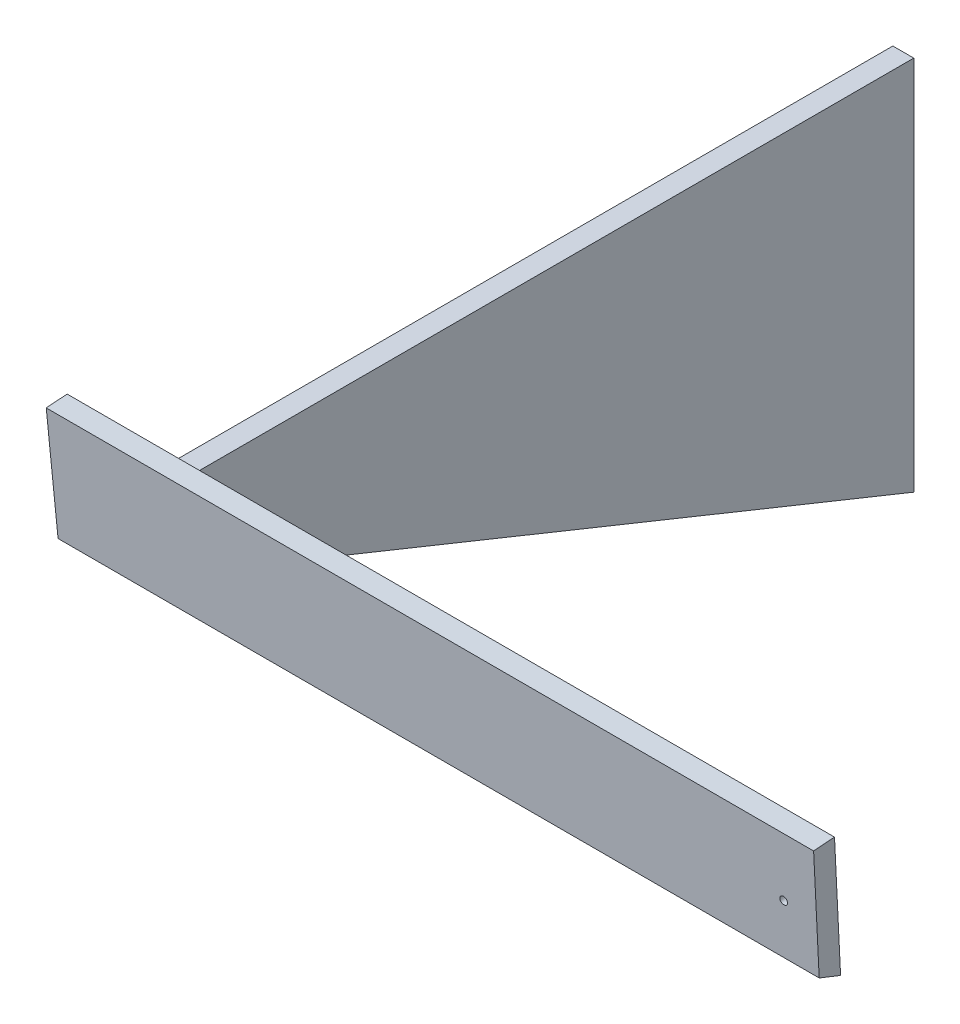
ISO-10303-21;
HEADER;
FILE_DESCRIPTION(('STEP AP214'),'2;1');
FILE_NAME('part.step','',(''),(''),'','','');
FILE_SCHEMA(('AUTOMOTIVE_DESIGN { 1 0 10303 214 1 1 1 1 }'));
ENDSEC;
DATA;
#1=APPLICATION_CONTEXT('core data for automotive mechanical design processes');
#2=APPLICATION_PROTOCOL_DEFINITION('international standard','automotive_design',2000,#1);
#3=PRODUCT_CONTEXT('',#1,'mechanical');
#4=PRODUCT('Part','Part','',(#3));
#5=PRODUCT_RELATED_PRODUCT_CATEGORY('part','',(#4));
#6=PRODUCT_DEFINITION_FORMATION('','',#4);
#7=PRODUCT_DEFINITION_CONTEXT('part definition',#1,'design');
#8=PRODUCT_DEFINITION('design','',#6,#7);
#9=PRODUCT_DEFINITION_SHAPE('','',#8);
#10=(LENGTH_UNIT() NAMED_UNIT(*) SI_UNIT(.MILLI.,.METRE.));
#11=(NAMED_UNIT(*) PLANE_ANGLE_UNIT() SI_UNIT($,.RADIAN.));
#12=(NAMED_UNIT(*) SI_UNIT($,.STERADIAN.) SOLID_ANGLE_UNIT());
#13=UNCERTAINTY_MEASURE_WITH_UNIT(LENGTH_MEASURE(1.E-05),#10,'distance_accuracy_value','');
#14=(GEOMETRIC_REPRESENTATION_CONTEXT(3) GLOBAL_UNCERTAINTY_ASSIGNED_CONTEXT((#13)) GLOBAL_UNIT_ASSIGNED_CONTEXT((#10,
#11,#12)) REPRESENTATION_CONTEXT('',''));
#15=CARTESIAN_POINT('',(0.,0.,0.));
#16=DIRECTION('',(0.,0.,1.));
#17=DIRECTION('',(1.,0.,0.));
#18=AXIS2_PLACEMENT_3D('',#15,#16,#17);
#19=CARTESIAN_POINT('',(-266.700000000033,6812.73593849404,3017.19500052049));
#20=DIRECTION('',(1.,0.,0.));
#21=DIRECTION('',(0.,1.,0.));
#22=AXIS2_PLACEMENT_3D('',#19,#20,#21);
#23=PLANE('',#22);
#24=CARTESIAN_POINT('',(-266.700000000027,6942.45499014012,3318.50999999998));
#25=DIRECTION('',(-1.,1.19356260075173E-13,0.));
#26=DIRECTION('',(-1.19356260075173E-13,-1.,0.));
#27=AXIS2_PLACEMENT_3D('',#24,#25,#26);
#28=CIRCLE('',#27,3.49249999999985);
#29=CARTESIAN_POINT('',(-266.700000000028,6938.96249014011,3318.50999999998));
#30=VERTEX_POINT('',#29);
#31=EDGE_CURVE('P0_E19',#30,#30,#28,.F.);
#32=ORIENTED_EDGE('',*,*,#31,.T.);
#33=EDGE_LOOP('',(#32));
#34=FACE_BOUND('',#33,.T.);
#35=DIRECTION('',(0.,0.37460659341596,0.927183854566768));
#36=VECTOR('',#35,1.);
#37=CARTESIAN_POINT('',(-266.700000000025,6641.741886848,2683.51));
#38=LINE('',#37,#36);
#39=CARTESIAN_POINT('',(-266.700000000029,6641.741886848,2683.51));
#40=VERTEX_POINT('',#39);
#41=CARTESIAN_POINT('',(-266.700000000031,6909.11469486815,3345.28092209158));
#42=VERTEX_POINT('',#41);
#43=EDGE_CURVE('P0_E59',#40,#42,#38,.T.);
#44=ORIENTED_EDGE('',*,*,#43,.T.);
#45=DIRECTION('',(0.,0.997196386906827,0.0748289111237776));
#46=VECTOR('',#45,1.);
#47=CARTESIAN_POINT('',(-266.700000000036,6909.11469486815,3345.28092209158));
#48=LINE('',#47,#46);
#49=CARTESIAN_POINT('',(-266.700000000037,6983.72999014007,3350.880001041));
#50=VERTEX_POINT('',#49);
#51=EDGE_CURVE('P0_E56',#42,#50,#48,.T.);
#52=ORIENTED_EDGE('',*,*,#51,.T.);
#53=DIRECTION('',(0.,0.,1.));
#54=VECTOR('',#53,1.);
#55=CARTESIAN_POINT('',(-266.700000000038,6983.72999014007,3350.880001041));
#56=LINE('',#55,#54);
#57=CARTESIAN_POINT('',(-266.700000000038,6983.72999014007,2683.51));
#58=VERTEX_POINT('',#57);
#59=EDGE_CURVE('P0_E82',#50,#58,#56,.F.);
#60=ORIENTED_EDGE('',*,*,#59,.T.);
#61=DIRECTION('',(0.,1.,0.));
#62=VECTOR('',#61,1.);
#63=CARTESIAN_POINT('',(-266.700000000038,6983.72999014007,2683.51));
#64=LINE('',#63,#62);
#65=EDGE_CURVE('P0_E60',#58,#40,#64,.F.);
#66=ORIENTED_EDGE('',*,*,#65,.T.);
#67=EDGE_LOOP('',(#44,#52,#60,#66));
#68=FACE_BOUND('',#67,.T.);
#69=ADVANCED_FACE('P0_F16',(#34,#68),#23,.F.);
#70=CARTESIAN_POINT('',(-266.700000000025,6641.741886848,2683.51));
#71=DIRECTION('',(0.,0.927183854566768,-0.37460659341596));
#72=DIRECTION('',(0.,0.37460659341596,0.927183854566768));
#73=AXIS2_PLACEMENT_3D('',#70,#71,#72);
#74=PLANE('',#73);
#75=DIRECTION('',(1.,0.,0.));
#76=VECTOR('',#75,1.);
#77=CARTESIAN_POINT('',(-266.700000000038,6641.741886848,2683.51));
#78=LINE('',#77,#76);
#79=CARTESIAN_POINT('',(-247.65000000003,6641.741886848,2683.51));
#80=VERTEX_POINT('',#79);
#81=EDGE_CURVE('P0_E85',#40,#80,#78,.T.);
#82=ORIENTED_EDGE('',*,*,#81,.T.);
#83=DIRECTION('',(0.,0.374606593415949,0.927183854566772));
#84=VECTOR('',#83,1.);
#85=CARTESIAN_POINT('',(-247.650000000019,6641.741886848,2683.51));
#86=LINE('',#85,#84);
#87=CARTESIAN_POINT('',(-247.650000000037,6909.11469486815,3345.28092209158));
#88=VERTEX_POINT('',#87);
#89=EDGE_CURVE('P0_E77',#80,#88,#86,.T.);
#90=ORIENTED_EDGE('',*,*,#89,.T.);
#91=DIRECTION('',(1.,0.,0.));
#92=VECTOR('',#91,1.);
#93=CARTESIAN_POINT('',(-266.700000000036,6909.11469486815,3345.28092209158));
#94=LINE('',#93,#92);
#95=EDGE_CURVE('P0_E65',#88,#42,#94,.F.);
#96=ORIENTED_EDGE('',*,*,#95,.T.);
#97=ORIENTED_EDGE('',*,*,#43,.F.);
#98=EDGE_LOOP('',(#82,#90,#96,#97));
#99=FACE_BOUND('',#98,.T.);
#100=ADVANCED_FACE('P0_F76',(#99),#74,.F.);
#101=CARTESIAN_POINT('',(-266.700000000036,6909.11469486815,3345.28092209158));
#102=DIRECTION('',(0.,0.0748289111237776,-0.997196386906827));
#103=DIRECTION('',(0.,0.997196386906827,0.0748289111237776));
#104=AXIS2_PLACEMENT_3D('',#101,#102,#103);
#105=PLANE('',#104);
#106=ORIENTED_EDGE('',*,*,#95,.F.);
#107=DIRECTION('',(0.,0.997196386906838,0.074828911123633));
#108=VECTOR('',#107,1.);
#109=CARTESIAN_POINT('',(-247.650000000035,6909.11469486815,3345.28092209158));
#110=LINE('',#109,#108);
#111=CARTESIAN_POINT('',(-247.650000000039,6983.72999014007,3350.880001041));
#112=VERTEX_POINT('',#111);
#113=EDGE_CURVE('P0_E91',#88,#112,#110,.T.);
#114=ORIENTED_EDGE('',*,*,#113,.T.);
#115=DIRECTION('',(1.,0.,0.));
#116=VECTOR('',#115,1.);
#117=CARTESIAN_POINT('',(-266.700000000038,6983.72999014007,3350.880001041));
#118=LINE('',#117,#116);
#119=EDGE_CURVE('P0_E72',#112,#50,#118,.F.);
#120=ORIENTED_EDGE('',*,*,#119,.T.);
#121=ORIENTED_EDGE('',*,*,#51,.F.);
#122=EDGE_LOOP('',(#106,#114,#120,#121));
#123=FACE_BOUND('',#122,.T.);
#124=ADVANCED_FACE('P0_F69',(#123),#105,.F.);
#125=CARTESIAN_POINT('',(-266.700000000038,6983.72999014007,3350.880001041));
#126=DIRECTION('',(0.,-1.,0.));
#127=DIRECTION('',(1.,0.,0.));
#128=AXIS2_PLACEMENT_3D('',#125,#126,#127);
#129=PLANE('',#128);
#130=ORIENTED_EDGE('',*,*,#119,.F.);
#131=DIRECTION('',(0.,0.,1.));
#132=VECTOR('',#131,1.);
#133=CARTESIAN_POINT('',(-247.650000000039,6983.72999014007,3017.19500052049));
#134=LINE('',#133,#132);
#135=CARTESIAN_POINT('',(-247.650000000036,6983.72999014007,2683.51));
#136=VERTEX_POINT('',#135);
#137=EDGE_CURVE('P0_E94',#112,#136,#134,.F.);
#138=ORIENTED_EDGE('',*,*,#137,.T.);
#139=DIRECTION('',(1.,0.,0.));
#140=VECTOR('',#139,1.);
#141=CARTESIAN_POINT('',(-266.700000000038,6983.72999014007,2683.51));
#142=LINE('',#141,#140);
#143=EDGE_CURVE('P0_E34',#136,#58,#142,.F.);
#144=ORIENTED_EDGE('',*,*,#143,.T.);
#145=ORIENTED_EDGE('',*,*,#59,.F.);
#146=EDGE_LOOP('',(#130,#138,#144,#145));
#147=FACE_BOUND('',#146,.T.);
#148=ADVANCED_FACE('P0_F103',(#147),#129,.F.);
#149=CARTESIAN_POINT('',(-266.700000000038,6983.72999014007,2683.51));
#150=DIRECTION('',(0.,0.,1.));
#151=DIRECTION('',(1.,0.,0.));
#152=AXIS2_PLACEMENT_3D('',#149,#150,#151);
#153=PLANE('',#152);
#154=ORIENTED_EDGE('',*,*,#143,.F.);
#155=DIRECTION('',(0.,-1.,0.));
#156=VECTOR('',#155,1.);
#157=CARTESIAN_POINT('',(-247.650000000029,6812.73593849404,2683.51));
#158=LINE('',#157,#156);
#159=EDGE_CURVE('P0_E26',#136,#80,#158,.T.);
#160=ORIENTED_EDGE('',*,*,#159,.T.);
#161=ORIENTED_EDGE('',*,*,#81,.F.);
#162=ORIENTED_EDGE('',*,*,#65,.F.);
#163=EDGE_LOOP('',(#154,#160,#161,#162));
#164=FACE_BOUND('',#163,.T.);
#165=ADVANCED_FACE('P0_F98',(#164),#153,.F.);
#166=CARTESIAN_POINT('',(285.750000000008,6942.45499014005,3318.51));
#167=DIRECTION('',(-1.,1.19356260075173E-13,0.));
#168=DIRECTION('',(-1.19356260075173E-13,-1.,0.));
#169=AXIS2_PLACEMENT_3D('',#166,#167,#168);
#170=CYLINDRICAL_SURFACE('',#169,3.49249999999985);
#171=CARTESIAN_POINT('',(-247.650000000023,6942.45499014011,3318.50999999998));
#172=DIRECTION('',(-1.,1.19356260075173E-13,0.));
#173=DIRECTION('',(-1.19356260075173E-13,-1.,0.));
#174=AXIS2_PLACEMENT_3D('',#171,#172,#173);
#175=CIRCLE('',#174,3.49249999999985);
#176=CARTESIAN_POINT('',(-247.650000000023,6938.96249014011,3318.50999999998));
#177=VERTEX_POINT('',#176);
#178=EDGE_CURVE('P0_E11',#177,#177,#175,.F.);
#179=ORIENTED_EDGE('',*,*,#178,.T.);
#180=EDGE_LOOP('',(#179));
#181=FACE_BOUND('',#180,.T.);
#182=ORIENTED_EDGE('',*,*,#31,.F.);
#183=EDGE_LOOP('',(#182));
#184=FACE_BOUND('',#183,.T.);
#185=ADVANCED_FACE('P0_F111',(#181,#184),#170,.F.);
#186=CARTESIAN_POINT('',(-247.650000000029,6812.73593849404,3017.19500052049));
#187=DIRECTION('',(-1.,0.,0.));
#188=DIRECTION('',(0.,-1.,0.));
#189=AXIS2_PLACEMENT_3D('',#186,#187,#188);
#190=PLANE('',#189);
#191=ORIENTED_EDGE('',*,*,#178,.F.);
#192=EDGE_LOOP('',(#191));
#193=FACE_BOUND('',#192,.T.);
#194=ORIENTED_EDGE('',*,*,#137,.F.);
#195=ORIENTED_EDGE('',*,*,#113,.F.);
#196=ORIENTED_EDGE('',*,*,#89,.F.);
#197=ORIENTED_EDGE('',*,*,#159,.F.);
#198=EDGE_LOOP('',(#194,#195,#196,#197));
#199=FACE_BOUND('',#198,.T.);
#200=ADVANCED_FACE('P0_F101',(#193,#199),#190,.F.);
#201=CLOSED_SHELL('',(#69,#100,#124,#148,#165,#185,#200));
#202=MANIFOLD_SOLID_BREP('P0_B1',#201);
#203=CARTESIAN_POINT('',(-1.13686837721616E-12,6895.88587766805,3363.3918));
#204=DIRECTION('',(0.,-0.0748289111295014,0.997196386906397));
#205=DIRECTION('',(0.,-0.997196386906397,-0.0748289111295014));
#206=AXIS2_PLACEMENT_3D('',#203,#204,#205);
#207=PLANE('',#206);
#208=CARTESIAN_POINT('',(317.5,6944.36472836717,3367.02961864662));
#209=DIRECTION('',(0.,0.0748289111295012,-0.997196386906397));
#210=DIRECTION('',(0.,0.997196386906397,0.0748289111295012));
#211=AXIS2_PLACEMENT_3D('',#208,#209,#210);
#212=CIRCLE('',#211,3.50520000000003);
#213=CARTESIAN_POINT('',(317.5,6947.86010114256,3367.29190894591));
#214=VERTEX_POINT('',#213);
#215=EDGE_CURVE('P1_E20',#214,#214,#212,.T.);
#216=ORIENTED_EDGE('',*,*,#215,.T.);
#217=EDGE_LOOP('',(#216));
#218=FACE_BOUND('',#217,.T.);
#219=DIRECTION('',(-0.0268750444697434,0.996836200329245,0.0748018829836659));
#220=VECTOR('',#219,1.);
#221=CARTESIAN_POINT('',(-346.19763219035,6895.88587766805,3363.3918));
#222=LINE('',#221,#220);
#223=CARTESIAN_POINT('',(-346.197632190351,6895.88587766805,3363.3918));
#224=VERTEX_POINT('',#223);
#225=CARTESIAN_POINT('',(-349.041102326057,7001.35450187887,3371.30609091767));
#226=VERTEX_POINT('',#225);
#227=EDGE_CURVE('P1_E76',#224,#226,#222,.T.);
#228=ORIENTED_EDGE('',*,*,#227,.F.);
#229=DIRECTION('',(1.,0.,0.));
#230=VECTOR('',#229,1.);
#231=CARTESIAN_POINT('',(0.,6895.88587766805,3363.3918));
#232=LINE('',#231,#230);
#233=CARTESIAN_POINT('',(346.197632190351,6895.88587766805,3363.3918));
#234=VERTEX_POINT('',#233);
#235=EDGE_CURVE('P1_E58',#234,#224,#232,.F.);
#236=ORIENTED_EDGE('',*,*,#235,.F.);
#237=DIRECTION('',(0.0268750444697434,0.996836200329245,0.0748018829836659));
#238=VECTOR('',#237,1.);
#239=CARTESIAN_POINT('',(346.19763219035,6895.88587766805,3363.3918));
#240=LINE('',#239,#238);
#241=CARTESIAN_POINT('',(349.041102326057,7001.35450187887,3371.30609091767));
#242=VERTEX_POINT('',#241);
#243=EDGE_CURVE('P1_E65',#234,#242,#240,.T.);
#244=ORIENTED_EDGE('',*,*,#243,.T.);
#245=DIRECTION('',(1.,0.,0.));
#246=VECTOR('',#245,1.);
#247=CARTESIAN_POINT('',(0.,7001.35450187887,3371.30609091767));
#248=LINE('',#247,#246);
#249=EDGE_CURVE('P1_E96',#226,#242,#248,.T.);
#250=ORIENTED_EDGE('',*,*,#249,.F.);
#251=EDGE_LOOP('',(#228,#236,#244,#250));
#252=FACE_BOUND('',#251,.T.);
#253=ADVANCED_FACE('P1_F17',(#218,#252),#207,.T.);
#254=CARTESIAN_POINT('',(315.783406950661,5767.77608949546,3278.73923989057));
#255=DIRECTION('',(-0.999638800759929,0.0267996972431762,0.00201103031422791));
#256=DIRECTION('',(-0.0267997514355836,-0.999640822157134,0.));
#257=AXIS2_PLACEMENT_3D('',#254,#255,#256);
#258=PLANE('',#257);
#259=DIRECTION('',(-0.0268750444697436,-0.996836200329245,-0.0748018829836711));
#260=VECTOR('',#259,1.);
#261=CARTESIAN_POINT('',(349.041102326056,7002.77999263588,3352.30949974709));
#262=LINE('',#261,#260);
#263=CARTESIAN_POINT('',(349.041102326057,7002.77999263588,3352.30949974709));
#264=VERTEX_POINT('',#263);
#265=CARTESIAN_POINT('',(345.944605360313,6887.9262191607,3343.69095387078));
#266=VERTEX_POINT('',#265);
#267=EDGE_CURVE('P1_E99',#264,#266,#262,.T.);
#268=ORIENTED_EDGE('',*,*,#267,.F.);
#269=DIRECTION('',(0.,-0.0748289111295065,0.997196386906397));
#270=VECTOR('',#269,1.);
#271=CARTESIAN_POINT('',(349.041102326056,7001.35450187887,3371.30609091767));
#272=LINE('',#271,#270);
#273=EDGE_CURVE('P1_E70',#242,#264,#272,.F.);
#274=ORIENTED_EDGE('',*,*,#273,.F.);
#275=ORIENTED_EDGE('',*,*,#243,.F.);
#276=DIRECTION('',(0.0119073951332687,0.374580035478333,0.927118121364366));
#277=VECTOR('',#276,1.);
#278=CARTESIAN_POINT('',(345.944605360312,6887.9262191607,3343.69095387078));
#279=LINE('',#278,#277);
#280=EDGE_CURVE('P1_E67',#266,#234,#279,.T.);
#281=ORIENTED_EDGE('',*,*,#280,.F.);
#282=EDGE_LOOP('',(#268,#274,#275,#281));
#283=FACE_BOUND('',#282,.T.);
#284=ADVANCED_FACE('P1_F66',(#283),#258,.F.);
#285=CARTESIAN_POINT('',(0.,6887.9262191607,3343.69095387078));
#286=DIRECTION('',(0.,-0.927183854566753,0.374606593415996));
#287=DIRECTION('',(0.,-0.374606593415996,-0.927183854566753));
#288=AXIS2_PLACEMENT_3D('',#285,#286,#287);
#289=PLANE('',#288);
#290=DIRECTION('',(-0.0119073951331615,0.374580035478247,0.927118121364402));
#291=VECTOR('',#290,1.);
#292=CARTESIAN_POINT('',(-345.944605360314,6887.9262191607,3343.69095387078));
#293=LINE('',#292,#291);
#294=CARTESIAN_POINT('',(-345.944605360313,6887.9262191607,3343.69095387078));
#295=VERTEX_POINT('',#294);
#296=EDGE_CURVE('P1_E79',#295,#224,#293,.T.);
#297=ORIENTED_EDGE('',*,*,#296,.F.);
#298=DIRECTION('',(1.,0.,0.));
#299=VECTOR('',#298,1.);
#300=CARTESIAN_POINT('',(0.,6887.9262191607,3343.69095387076));
#301=LINE('',#300,#299);
#302=EDGE_CURVE('P1_E83',#266,#295,#301,.F.);
#303=ORIENTED_EDGE('',*,*,#302,.F.);
#304=ORIENTED_EDGE('',*,*,#280,.T.);
#305=ORIENTED_EDGE('',*,*,#235,.T.);
#306=EDGE_LOOP('',(#297,#303,#304,#305));
#307=FACE_BOUND('',#306,.T.);
#308=ADVANCED_FACE('P1_F81',(#307),#289,.T.);
#309=CARTESIAN_POINT('',(-315.783406950661,5767.77608949546,3278.73923989057));
#310=DIRECTION('',(-0.999638800759929,-0.0267996972431762,-0.00201103031422791));
#311=DIRECTION('',(0.0267997514355836,-0.999640822157134,0.));
#312=AXIS2_PLACEMENT_3D('',#309,#310,#311);
#313=PLANE('',#312);
#314=DIRECTION('',(0.,-0.0748289111295065,0.997196386906397));
#315=VECTOR('',#314,1.);
#316=CARTESIAN_POINT('',(-349.041102326056,7001.35450187887,3371.30609091767));
#317=LINE('',#316,#315);
#318=CARTESIAN_POINT('',(-349.041102326057,7002.77999263588,3352.30949974709));
#319=VERTEX_POINT('',#318);
#320=EDGE_CURVE('P1_E35',#319,#226,#317,.T.);
#321=ORIENTED_EDGE('',*,*,#320,.F.);
#322=DIRECTION('',(-0.0268750444697436,0.996836200329245,0.0748018829836711));
#323=VECTOR('',#322,1.);
#324=CARTESIAN_POINT('',(-345.944605360312,6887.9262191607,3343.69095387076));
#325=LINE('',#324,#323);
#326=EDGE_CURVE('P1_E103',#295,#319,#325,.T.);
#327=ORIENTED_EDGE('',*,*,#326,.F.);
#328=ORIENTED_EDGE('',*,*,#296,.T.);
#329=ORIENTED_EDGE('',*,*,#227,.T.);
#330=EDGE_LOOP('',(#321,#327,#328,#329));
#331=FACE_BOUND('',#330,.T.);
#332=ADVANCED_FACE('P1_F114',(#331),#313,.T.);
#333=CARTESIAN_POINT('',(0.,7001.35450187887,3371.30609091767));
#334=DIRECTION('',(0.,0.997196386906397,0.0748289111295065));
#335=DIRECTION('',(0.,-0.0748289111295065,0.997196386906397));
#336=AXIS2_PLACEMENT_3D('',#333,#334,#335);
#337=PLANE('',#336);
#338=ORIENTED_EDGE('',*,*,#320,.T.);
#339=ORIENTED_EDGE('',*,*,#249,.T.);
#340=ORIENTED_EDGE('',*,*,#273,.T.);
#341=DIRECTION('',(1.,0.,0.));
#342=VECTOR('',#341,1.);
#343=CARTESIAN_POINT('',(0.,7002.77999263588,3352.30949974709));
#344=LINE('',#343,#342);
#345=EDGE_CURVE('P1_E27',#319,#264,#344,.T.);
#346=ORIENTED_EDGE('',*,*,#345,.F.);
#347=EDGE_LOOP('',(#338,#339,#340,#346));
#348=FACE_BOUND('',#347,.T.);
#349=ADVANCED_FACE('P1_F111',(#348),#337,.T.);
#350=CARTESIAN_POINT('',(317.5,6944.36472836717,3367.02961864662));
#351=DIRECTION('',(0.,0.0748289111295012,-0.997196386906397));
#352=DIRECTION('',(0.,0.997196386906397,0.0748289111295012));
#353=AXIS2_PLACEMENT_3D('',#350,#351,#352);
#354=CYLINDRICAL_SURFACE('',#353,3.50520000000003);
#355=ORIENTED_EDGE('',*,*,#215,.F.);
#356=EDGE_LOOP('',(#355));
#357=FACE_BOUND('',#356,.T.);
#358=CARTESIAN_POINT('',(317.5,6945.79021912419,3348.03302747605));
#359=DIRECTION('',(0.,0.0748289111295012,-0.997196386906397));
#360=DIRECTION('',(0.,0.997196386906397,0.0748289111295012));
#361=AXIS2_PLACEMENT_3D('',#358,#359,#360);
#362=CIRCLE('',#361,3.50520000000003);
#363=CARTESIAN_POINT('',(317.5,6949.28559189958,3348.29531777534));
#364=VERTEX_POINT('',#363);
#365=EDGE_CURVE('P1_E11',#364,#364,#362,.F.);
#366=ORIENTED_EDGE('',*,*,#365,.F.);
#367=EDGE_LOOP('',(#366));
#368=FACE_BOUND('',#367,.T.);
#369=ADVANCED_FACE('P1_F113',(#357,#368),#354,.F.);
#370=CARTESIAN_POINT('',(0.,7002.77999263588,3352.30949974709));
#371=DIRECTION('',(0.,0.0748289111295055,-0.997196386906397));
#372=DIRECTION('',(0.,0.997196386906397,0.0748289111295055));
#373=AXIS2_PLACEMENT_3D('',#370,#371,#372);
#374=PLANE('',#373);
#375=ORIENTED_EDGE('',*,*,#365,.T.);
#376=EDGE_LOOP('',(#375));
#377=FACE_BOUND('',#376,.T.);
#378=ORIENTED_EDGE('',*,*,#326,.T.);
#379=ORIENTED_EDGE('',*,*,#345,.T.);
#380=ORIENTED_EDGE('',*,*,#267,.T.);
#381=ORIENTED_EDGE('',*,*,#302,.T.);
#382=EDGE_LOOP('',(#378,#379,#380,#381));
#383=FACE_BOUND('',#382,.T.);
#384=ADVANCED_FACE('P1_F109',(#377,#383),#374,.T.);
#385=CLOSED_SHELL('',(#253,#284,#308,#332,#349,#369,#384));
#386=MANIFOLD_SOLID_BREP('P1_B1',#385);
#387=ADVANCED_BREP_SHAPE_REPRESENTATION('',(#18,#202,#386),#14);
#388=SHAPE_DEFINITION_REPRESENTATION(#9,#387);
ENDSEC;
END-ISO-10303-21;
